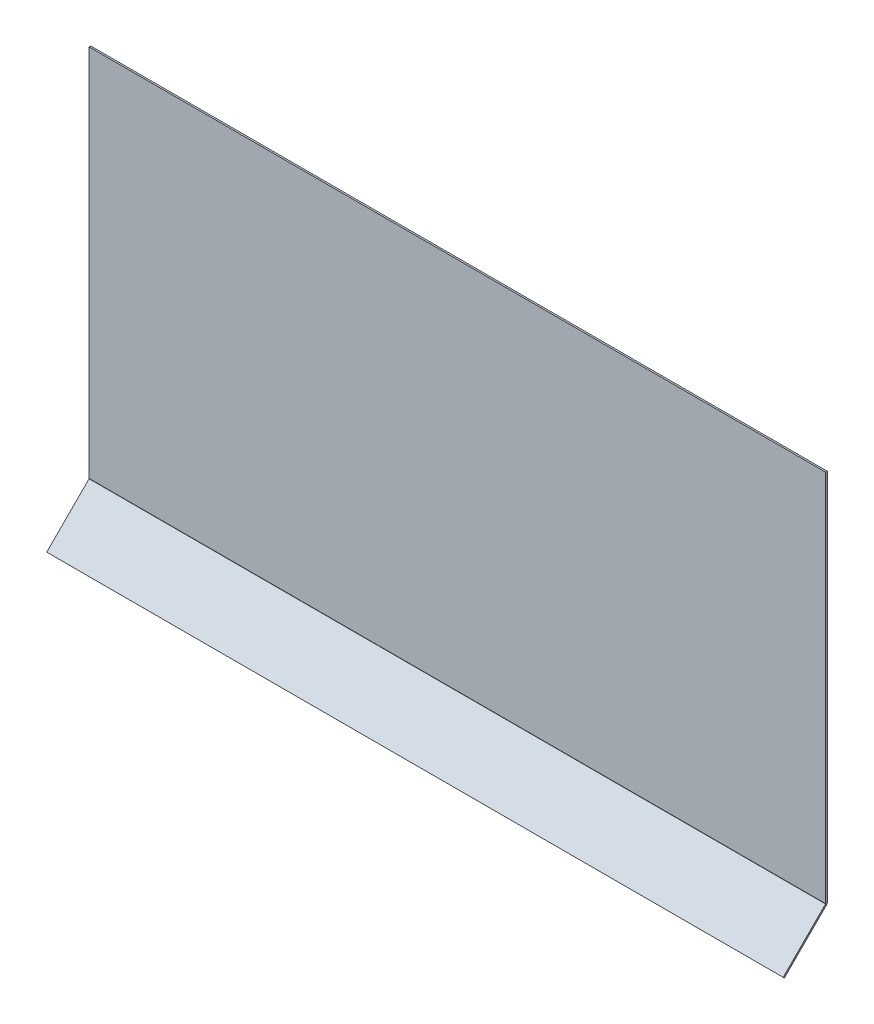
ISO-10303-21;
HEADER;
FILE_DESCRIPTION(('STEP AP214'),'2;1');
FILE_NAME('part.step','',(''),(''),'','','');
FILE_SCHEMA(('AUTOMOTIVE_DESIGN { 1 0 10303 214 1 1 1 1 }'));
ENDSEC;
DATA;
#1=APPLICATION_CONTEXT('core data for automotive mechanical design processes');
#2=APPLICATION_PROTOCOL_DEFINITION('international standard','automotive_design',2000,#1);
#3=PRODUCT_CONTEXT('',#1,'mechanical');
#4=PRODUCT('Part','Part','',(#3));
#5=PRODUCT_RELATED_PRODUCT_CATEGORY('part','',(#4));
#6=PRODUCT_DEFINITION_FORMATION('','',#4);
#7=PRODUCT_DEFINITION_CONTEXT('part definition',#1,'design');
#8=PRODUCT_DEFINITION('design','',#6,#7);
#9=PRODUCT_DEFINITION_SHAPE('','',#8);
#10=(LENGTH_UNIT() NAMED_UNIT(*) SI_UNIT(.MILLI.,.METRE.));
#11=(NAMED_UNIT(*) PLANE_ANGLE_UNIT() SI_UNIT($,.RADIAN.));
#12=(NAMED_UNIT(*) SI_UNIT($,.STERADIAN.) SOLID_ANGLE_UNIT());
#13=UNCERTAINTY_MEASURE_WITH_UNIT(LENGTH_MEASURE(1.E-05),#10,'distance_accuracy_value','');
#14=(GEOMETRIC_REPRESENTATION_CONTEXT(3) GLOBAL_UNCERTAINTY_ASSIGNED_CONTEXT((#13)) GLOBAL_UNIT_ASSIGNED_CONTEXT((#10,
#11,#12)) REPRESENTATION_CONTEXT('',''));
#15=CARTESIAN_POINT('',(0.,0.,0.));
#16=DIRECTION('',(0.,0.,1.));
#17=DIRECTION('',(1.,0.,0.));
#18=AXIS2_PLACEMENT_3D('',#15,#16,#17);
#19=CARTESIAN_POINT('',(-675.,-363.086855640565,-687.218254069481));
#20=DIRECTION('',(0.,-0.707106781186552,0.707106781186544));
#21=DIRECTION('',(1.,0.,0.));
#22=AXIS2_PLACEMENT_3D('',#19,#20,#21);
#23=PLANE('',#22);
#24=DIRECTION('',(0.,0.707106781186544,0.707106781186552));
#25=VECTOR('',#24,1.);
#26=CARTESIAN_POINT('',(-675.,-363.086855640565,-687.218254069481));
#27=LINE('',#26,#25);
#28=CARTESIAN_POINT('',(-675.,-365.208175984124,-689.33957441304));
#29=VERTEX_POINT('',#28);
#30=CARTESIAN_POINT('',(-675.,-363.086855640565,-687.218254069481));
#31=VERTEX_POINT('',#30);
#32=EDGE_CURVE('E11',#29,#31,#27,.T.);
#33=ORIENTED_EDGE('',*,*,#32,.F.);
#34=DIRECTION('',(1.,0.,0.));
#35=VECTOR('',#34,1.);
#36=CARTESIAN_POINT('',(0.,-365.208175984124,-689.33957441304));
#37=LINE('',#36,#35);
#38=CARTESIAN_POINT('',(675.,-365.208175984124,-689.339574413041));
#39=VERTEX_POINT('',#38);
#40=EDGE_CURVE('E114',#39,#29,#37,.F.);
#41=ORIENTED_EDGE('',*,*,#40,.F.);
#42=DIRECTION('',(0.,0.707106781186544,0.707106781186552));
#43=VECTOR('',#42,1.);
#44=CARTESIAN_POINT('',(675.,-363.086855640565,-687.218254069481));
#45=LINE('',#44,#43);
#46=CARTESIAN_POINT('',(675.,-363.086855640565,-687.218254069481));
#47=VERTEX_POINT('',#46);
#48=EDGE_CURVE('E47',#39,#47,#45,.T.);
#49=ORIENTED_EDGE('',*,*,#48,.T.);
#50=DIRECTION('',(1.,0.,0.));
#51=VECTOR('',#50,1.);
#52=CARTESIAN_POINT('',(-675.,-363.086855640565,-687.218254069481));
#53=LINE('',#52,#51);
#54=EDGE_CURVE('E163',#47,#31,#53,.F.);
#55=ORIENTED_EDGE('',*,*,#54,.T.);
#56=EDGE_LOOP('',(#33,#41,#49,#55));
#57=FACE_BOUND('',#56,.T.);
#58=ADVANCED_FACE('F37',(#57),#23,.T.);
#59=CARTESIAN_POINT('',(675.,-363.086855640565,-687.218254069481));
#60=DIRECTION('',(1.,0.,0.));
#61=DIRECTION('',(0.,0.707106781186552,-0.707106781186544));
#62=AXIS2_PLACEMENT_3D('',#59,#60,#61);
#63=PLANE('',#62);
#64=ORIENTED_EDGE('',*,*,#48,.F.);
#65=DIRECTION('',(0.,-0.707106781186552,0.707106781186544));
#66=VECTOR('',#65,1.);
#67=CARTESIAN_POINT('',(675.,-527.426430053602,-527.121320343564));
#68=LINE('',#67,#66);
#69=CARTESIAN_POINT('',(675.,-287.642175198582,-766.905575198582));
#70=VERTEX_POINT('',#69);
#71=EDGE_CURVE('E111',#70,#39,#68,.T.);
#72=ORIENTED_EDGE('',*,*,#71,.F.);
#73=DIRECTION('',(0.,0.707106781186547,0.707106781186547));
#74=VECTOR('',#73,1.);
#75=CARTESIAN_POINT('',(675.,-285.520854855022,-764.784254855022));
#76=LINE('',#75,#74);
#77=CARTESIAN_POINT('',(675.,-285.520854855022,-764.784254855022));
#78=VERTEX_POINT('',#77);
#79=EDGE_CURVE('E146',#70,#78,#76,.T.);
#80=ORIENTED_EDGE('',*,*,#79,.T.);
#81=DIRECTION('',(0.,0.707106781186552,-0.707106781186544));
#82=VECTOR('',#81,1.);
#83=CARTESIAN_POINT('',(675.,-363.086855640565,-687.218254069481));
#84=LINE('',#83,#82);
#85=EDGE_CURVE('E154',#78,#47,#84,.F.);
#86=ORIENTED_EDGE('',*,*,#85,.T.);
#87=EDGE_LOOP('',(#64,#72,#80,#86));
#88=FACE_BOUND('',#87,.T.);
#89=ADVANCED_FACE('F153',(#88),#63,.T.);
#90=CARTESIAN_POINT('',(675.,-285.,-764.2634));
#91=DIRECTION('',(-1.,0.,0.));
#92=DIRECTION('',(0.,0.,1.));
#93=AXIS2_PLACEMENT_3D('',#90,#91,#92);
#94=PLANE('',#93);
#95=ORIENTED_EDGE('',*,*,#79,.F.);
#96=CARTESIAN_POINT('',(675.,-285.,-764.2634));
#97=DIRECTION('',(1.,0.,0.));
#98=DIRECTION('',(0.,0.,-1.));
#99=AXIS2_PLACEMENT_3D('',#96,#97,#98);
#100=CIRCLE('',#99,3.73660000000008);
#101=CARTESIAN_POINT('',(675.,-285.,-768.));
#102=VERTEX_POINT('',#101);
#103=EDGE_CURVE('E107',#70,#102,#100,.T.);
#104=ORIENTED_EDGE('',*,*,#103,.T.);
#105=DIRECTION('',(0.,0.,1.));
#106=VECTOR('',#105,1.);
#107=CARTESIAN_POINT('',(675.,-285.,-765.));
#108=LINE('',#107,#106);
#109=CARTESIAN_POINT('',(675.,-285.,-765.));
#110=VERTEX_POINT('',#109);
#111=EDGE_CURVE('E143',#102,#110,#108,.T.);
#112=ORIENTED_EDGE('',*,*,#111,.T.);
#113=CARTESIAN_POINT('',(675.,-285.,-764.2634));
#114=DIRECTION('',(1.,0.,0.));
#115=DIRECTION('',(0.,0.,-1.));
#116=AXIS2_PLACEMENT_3D('',#113,#114,#115);
#117=CIRCLE('',#116,0.736600000000081);
#118=EDGE_CURVE('E96',#78,#110,#117,.T.);
#119=ORIENTED_EDGE('',*,*,#118,.F.);
#120=EDGE_LOOP('',(#95,#104,#112,#119));
#121=FACE_BOUND('',#120,.T.);
#122=ADVANCED_FACE('F167',(#121),#94,.F.);
#123=CARTESIAN_POINT('',(675.,400.,-765.));
#124=DIRECTION('',(1.,0.,0.));
#125=DIRECTION('',(0.,-1.,0.));
#126=AXIS2_PLACEMENT_3D('',#123,#124,#125);
#127=PLANE('',#126);
#128=ORIENTED_EDGE('',*,*,#111,.F.);
#129=DIRECTION('',(0.,1.,0.));
#130=VECTOR('',#129,1.);
#131=CARTESIAN_POINT('',(675.,2.11801214624424E-13,-768.));
#132=LINE('',#131,#130);
#133=CARTESIAN_POINT('',(675.,400.,-768.));
#134=VERTEX_POINT('',#133);
#135=EDGE_CURVE('E132',#134,#102,#132,.F.);
#136=ORIENTED_EDGE('',*,*,#135,.F.);
#137=DIRECTION('',(0.,0.,1.));
#138=VECTOR('',#137,1.);
#139=CARTESIAN_POINT('',(675.,400.,-765.));
#140=LINE('',#139,#138);
#141=CARTESIAN_POINT('',(675.,400.,-765.));
#142=VERTEX_POINT('',#141);
#143=EDGE_CURVE('E140',#134,#142,#140,.T.);
#144=ORIENTED_EDGE('',*,*,#143,.T.);
#145=DIRECTION('',(0.,-1.,0.));
#146=VECTOR('',#145,1.);
#147=CARTESIAN_POINT('',(675.,400.,-765.));
#148=LINE('',#147,#146);
#149=EDGE_CURVE('E189',#142,#110,#148,.T.);
#150=ORIENTED_EDGE('',*,*,#149,.T.);
#151=EDGE_LOOP('',(#128,#136,#144,#150));
#152=FACE_BOUND('',#151,.T.);
#153=ADVANCED_FACE('F186',(#152),#127,.T.);
#154=CARTESIAN_POINT('',(675.,400.,-765.));
#155=DIRECTION('',(0.,1.,0.));
#156=DIRECTION('',(1.,0.,0.));
#157=AXIS2_PLACEMENT_3D('',#154,#155,#156);
#158=PLANE('',#157);
#159=ORIENTED_EDGE('',*,*,#143,.F.);
#160=DIRECTION('',(1.,0.,0.));
#161=VECTOR('',#160,1.);
#162=CARTESIAN_POINT('',(0.,400.,-768.));
#163=LINE('',#162,#161);
#164=CARTESIAN_POINT('',(-675.,400.,-768.));
#165=VERTEX_POINT('',#164);
#166=EDGE_CURVE('E129',#165,#134,#163,.T.);
#167=ORIENTED_EDGE('',*,*,#166,.F.);
#168=DIRECTION('',(0.,0.,1.));
#169=VECTOR('',#168,1.);
#170=CARTESIAN_POINT('',(-675.,400.,-765.));
#171=LINE('',#170,#169);
#172=CARTESIAN_POINT('',(-675.,400.,-765.));
#173=VERTEX_POINT('',#172);
#174=EDGE_CURVE('E137',#165,#173,#171,.T.);
#175=ORIENTED_EDGE('',*,*,#174,.T.);
#176=DIRECTION('',(1.,0.,0.));
#177=VECTOR('',#176,1.);
#178=CARTESIAN_POINT('',(675.,400.,-765.));
#179=LINE('',#178,#177);
#180=EDGE_CURVE('E164',#173,#142,#179,.T.);
#181=ORIENTED_EDGE('',*,*,#180,.T.);
#182=EDGE_LOOP('',(#159,#167,#175,#181));
#183=FACE_BOUND('',#182,.T.);
#184=ADVANCED_FACE('F207',(#183),#158,.T.);
#185=CARTESIAN_POINT('',(-675.,400.,-765.));
#186=DIRECTION('',(-1.,0.,0.));
#187=DIRECTION('',(0.,1.,0.));
#188=AXIS2_PLACEMENT_3D('',#185,#186,#187);
#189=PLANE('',#188);
#190=ORIENTED_EDGE('',*,*,#174,.F.);
#191=DIRECTION('',(0.,1.,0.));
#192=VECTOR('',#191,1.);
#193=CARTESIAN_POINT('',(-675.,2.11801214624424E-13,-768.));
#194=LINE('',#193,#192);
#195=CARTESIAN_POINT('',(-675.,-285.,-768.));
#196=VERTEX_POINT('',#195);
#197=EDGE_CURVE('E125',#196,#165,#194,.T.);
#198=ORIENTED_EDGE('',*,*,#197,.F.);
#199=DIRECTION('',(0.,-1.50722647926309E-13,1.));
#200=VECTOR('',#199,1.);
#201=CARTESIAN_POINT('',(-675.,-285.,-765.));
#202=LINE('',#201,#200);
#203=CARTESIAN_POINT('',(-675.,-285.,-765.));
#204=VERTEX_POINT('',#203);
#205=EDGE_CURVE('E95',#196,#204,#202,.T.);
#206=ORIENTED_EDGE('',*,*,#205,.T.);
#207=DIRECTION('',(0.,1.,0.));
#208=VECTOR('',#207,1.);
#209=CARTESIAN_POINT('',(-675.,400.,-765.));
#210=LINE('',#209,#208);
#211=EDGE_CURVE('E120',#204,#173,#210,.T.);
#212=ORIENTED_EDGE('',*,*,#211,.T.);
#213=EDGE_LOOP('',(#190,#198,#206,#212));
#214=FACE_BOUND('',#213,.T.);
#215=ADVANCED_FACE('F201',(#214),#189,.T.);
#216=CARTESIAN_POINT('',(-675.,-285.,-764.2634));
#217=DIRECTION('',(-1.,0.,0.));
#218=DIRECTION('',(0.,0.,1.));
#219=AXIS2_PLACEMENT_3D('',#216,#217,#218);
#220=PLANE('',#219);
#221=ORIENTED_EDGE('',*,*,#205,.F.);
#222=CARTESIAN_POINT('',(-675.,-285.,-764.2634));
#223=DIRECTION('',(1.,0.,0.));
#224=DIRECTION('',(0.,0.,-1.));
#225=AXIS2_PLACEMENT_3D('',#222,#223,#224);
#226=CIRCLE('',#225,3.73660000000008);
#227=CARTESIAN_POINT('',(-675.,-287.642175198581,-766.905575198582));
#228=VERTEX_POINT('',#227);
#229=EDGE_CURVE('E104',#196,#228,#226,.F.);
#230=ORIENTED_EDGE('',*,*,#229,.T.);
#231=DIRECTION('',(0.,0.707106781186544,0.707106781186552));
#232=VECTOR('',#231,1.);
#233=CARTESIAN_POINT('',(-675.,-285.520854855022,-764.784254855022));
#234=LINE('',#233,#232);
#235=CARTESIAN_POINT('',(-675.,-285.520854855022,-764.784254855022));
#236=VERTEX_POINT('',#235);
#237=EDGE_CURVE('E41',#228,#236,#234,.T.);
#238=ORIENTED_EDGE('',*,*,#237,.T.);
#239=CARTESIAN_POINT('',(-675.,-285.,-764.2634));
#240=DIRECTION('',(1.,0.,0.));
#241=DIRECTION('',(0.,0.,-1.));
#242=AXIS2_PLACEMENT_3D('',#239,#240,#241);
#243=CIRCLE('',#242,0.736600000000081);
#244=EDGE_CURVE('E173',#204,#236,#243,.F.);
#245=ORIENTED_EDGE('',*,*,#244,.F.);
#246=EDGE_LOOP('',(#221,#230,#238,#245));
#247=FACE_BOUND('',#246,.T.);
#248=ADVANCED_FACE('F116',(#247),#220,.T.);
#249=CARTESIAN_POINT('',(-675.,-285.305109710044,-765.000000000001));
#250=DIRECTION('',(-1.,0.,0.));
#251=DIRECTION('',(0.,-0.707106781186552,0.707106781186544));
#252=AXIS2_PLACEMENT_3D('',#249,#250,#251);
#253=PLANE('',#252);
#254=DIRECTION('',(0.,-0.707106781186552,0.707106781186544));
#255=VECTOR('',#254,1.);
#256=CARTESIAN_POINT('',(-675.,-527.426430053602,-527.121320343564));
#257=LINE('',#256,#255);
#258=EDGE_CURVE('E87',#29,#228,#257,.F.);
#259=ORIENTED_EDGE('',*,*,#258,.F.);
#260=ORIENTED_EDGE('',*,*,#32,.T.);
#261=DIRECTION('',(0.,-0.707106781186552,0.707106781186544));
#262=VECTOR('',#261,1.);
#263=CARTESIAN_POINT('',(-675.,-285.305109710044,-765.000000000001));
#264=LINE('',#263,#262);
#265=EDGE_CURVE('E89',#31,#236,#264,.F.);
#266=ORIENTED_EDGE('',*,*,#265,.T.);
#267=ORIENTED_EDGE('',*,*,#237,.F.);
#268=EDGE_LOOP('',(#259,#260,#266,#267));
#269=FACE_BOUND('',#268,.T.);
#270=ADVANCED_FACE('F39',(#269),#253,.T.);
#271=CARTESIAN_POINT('',(675.,-285.,-764.2634));
#272=DIRECTION('',(1.,0.,0.));
#273=DIRECTION('',(0.,-0.707106781186544,-0.707106781186552));
#274=AXIS2_PLACEMENT_3D('',#271,#272,#273);
#275=CYLINDRICAL_SURFACE('',#274,0.736600000000081);
#276=DIRECTION('',(-1.,0.,0.));
#277=VECTOR('',#276,1.);
#278=CARTESIAN_POINT('',(675.,-285.,-765.));
#279=LINE('',#278,#277);
#280=EDGE_CURVE('E194',#110,#204,#279,.T.);
#281=ORIENTED_EDGE('',*,*,#280,.T.);
#282=ORIENTED_EDGE('',*,*,#244,.T.);
#283=DIRECTION('',(1.,0.,0.));
#284=VECTOR('',#283,1.);
#285=CARTESIAN_POINT('',(-675.,-285.520854855022,-764.784254855022));
#286=LINE('',#285,#284);
#287=EDGE_CURVE('E162',#236,#78,#286,.T.);
#288=ORIENTED_EDGE('',*,*,#287,.T.);
#289=ORIENTED_EDGE('',*,*,#118,.T.);
#290=EDGE_LOOP('',(#281,#282,#288,#289));
#291=FACE_BOUND('',#290,.T.);
#292=ADVANCED_FACE('F175',(#291),#275,.F.);
#293=CARTESIAN_POINT('',(0.,-525.305109710043,-525.000000000005));
#294=DIRECTION('',(0.,0.707106781186544,0.707106781186552));
#295=DIRECTION('',(0.,-0.707106781186552,0.707106781186544));
#296=AXIS2_PLACEMENT_3D('',#293,#294,#295);
#297=PLANE('',#296);
#298=ORIENTED_EDGE('',*,*,#85,.F.);
#299=ORIENTED_EDGE('',*,*,#287,.F.);
#300=ORIENTED_EDGE('',*,*,#265,.F.);
#301=ORIENTED_EDGE('',*,*,#54,.F.);
#302=EDGE_LOOP('',(#298,#299,#300,#301));
#303=FACE_BOUND('',#302,.T.);
#304=ADVANCED_FACE('F160',(#303),#297,.T.);
#305=CARTESIAN_POINT('',(0.,2.10973719202344E-13,-765.));
#306=DIRECTION('',(0.,0.,-1.));
#307=DIRECTION('',(0.,1.,0.));
#308=AXIS2_PLACEMENT_3D('',#305,#306,#307);
#309=PLANE('',#308);
#310=ORIENTED_EDGE('',*,*,#211,.F.);
#311=ORIENTED_EDGE('',*,*,#280,.F.);
#312=ORIENTED_EDGE('',*,*,#149,.F.);
#313=ORIENTED_EDGE('',*,*,#180,.F.);
#314=EDGE_LOOP('',(#310,#311,#312,#313));
#315=FACE_BOUND('',#314,.T.);
#316=ADVANCED_FACE('F203',(#315),#309,.F.);
#317=CARTESIAN_POINT('',(675.,-285.,-764.2634));
#318=DIRECTION('',(1.,0.,0.));
#319=DIRECTION('',(0.,-0.707106781186544,-0.707106781186552));
#320=AXIS2_PLACEMENT_3D('',#317,#318,#319);
#321=CYLINDRICAL_SURFACE('',#320,3.73660000000008);
#322=DIRECTION('',(1.,0.,0.));
#323=VECTOR('',#322,1.);
#324=CARTESIAN_POINT('',(675.,-285.,-768.));
#325=LINE('',#324,#323);
#326=EDGE_CURVE('E128',#102,#196,#325,.F.);
#327=ORIENTED_EDGE('',*,*,#326,.F.);
#328=ORIENTED_EDGE('',*,*,#103,.F.);
#329=DIRECTION('',(1.,0.,0.));
#330=VECTOR('',#329,1.);
#331=CARTESIAN_POINT('',(675.,-287.642175198581,-766.905575198582));
#332=LINE('',#331,#330);
#333=EDGE_CURVE('E101',#228,#70,#332,.T.);
#334=ORIENTED_EDGE('',*,*,#333,.F.);
#335=ORIENTED_EDGE('',*,*,#229,.F.);
#336=EDGE_LOOP('',(#327,#328,#334,#335));
#337=FACE_BOUND('',#336,.T.);
#338=ADVANCED_FACE('F103',(#337),#321,.T.);
#339=CARTESIAN_POINT('',(0.,-527.426430053602,-527.121320343564));
#340=DIRECTION('',(0.,0.707106781186544,0.707106781186552));
#341=DIRECTION('',(0.,-0.707106781186552,0.707106781186544));
#342=AXIS2_PLACEMENT_3D('',#339,#340,#341);
#343=PLANE('',#342);
#344=ORIENTED_EDGE('',*,*,#71,.T.);
#345=ORIENTED_EDGE('',*,*,#40,.T.);
#346=ORIENTED_EDGE('',*,*,#258,.T.);
#347=ORIENTED_EDGE('',*,*,#333,.T.);
#348=EDGE_LOOP('',(#344,#345,#346,#347));
#349=FACE_BOUND('',#348,.T.);
#350=ADVANCED_FACE('F113',(#349),#343,.F.);
#351=CARTESIAN_POINT('',(0.,2.11801214624424E-13,-768.));
#352=DIRECTION('',(0.,0.,-1.));
#353=DIRECTION('',(0.,1.,0.));
#354=AXIS2_PLACEMENT_3D('',#351,#352,#353);
#355=PLANE('',#354);
#356=ORIENTED_EDGE('',*,*,#197,.T.);
#357=ORIENTED_EDGE('',*,*,#166,.T.);
#358=ORIENTED_EDGE('',*,*,#135,.T.);
#359=ORIENTED_EDGE('',*,*,#326,.T.);
#360=EDGE_LOOP('',(#356,#357,#358,#359));
#361=FACE_BOUND('',#360,.T.);
#362=ADVANCED_FACE('F182',(#361),#355,.T.);
#363=CLOSED_SHELL('',(#58,#89,#122,#153,#184,#215,#248,#270,#292,#304,#316,#338,#350,#362));
#364=MANIFOLD_SOLID_BREP('B2',#363);
#365=ADVANCED_BREP_SHAPE_REPRESENTATION('',(#18,#364),#14);
#366=SHAPE_DEFINITION_REPRESENTATION(#9,#365);
ENDSEC;
END-ISO-10303-21;
